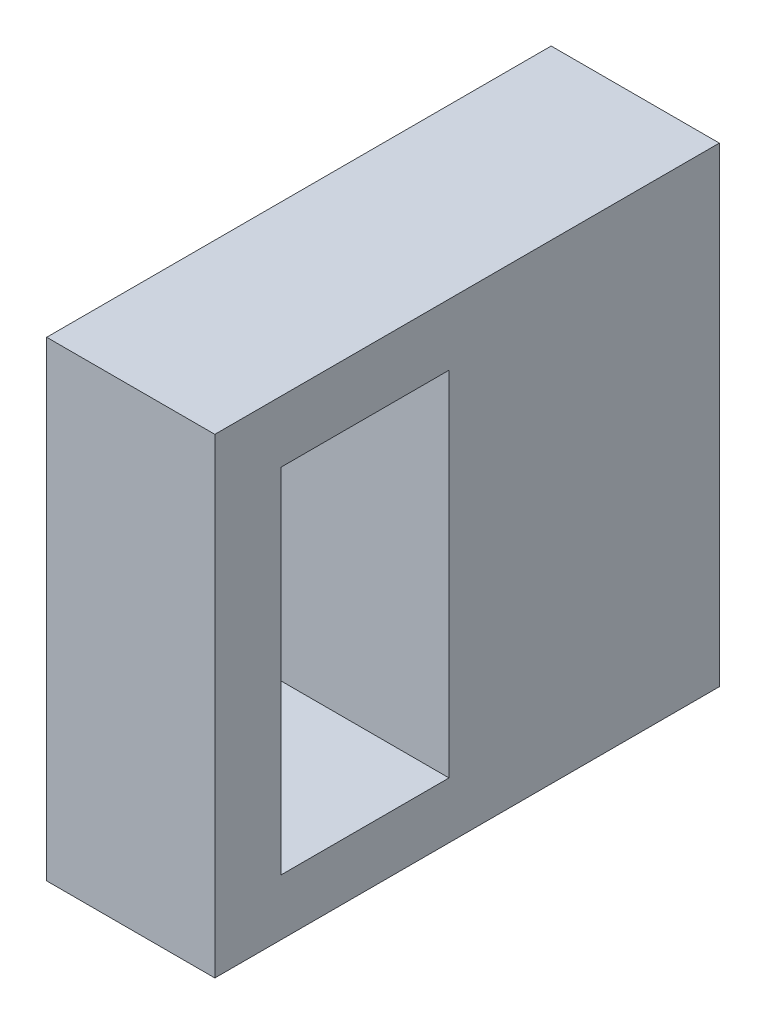
ISO-10303-21;
HEADER;
FILE_DESCRIPTION(('STEP AP214'),'2;1');
FILE_NAME('part.step','',(''),(''),'','','');
FILE_SCHEMA(('AUTOMOTIVE_DESIGN { 1 0 10303 214 1 1 1 1 }'));
ENDSEC;
DATA;
#1=APPLICATION_CONTEXT('core data for automotive mechanical design processes');
#2=APPLICATION_PROTOCOL_DEFINITION('international standard','automotive_design',2000,#1);
#3=PRODUCT_CONTEXT('',#1,'mechanical');
#4=PRODUCT('Part','Part','',(#3));
#5=PRODUCT_RELATED_PRODUCT_CATEGORY('part','',(#4));
#6=PRODUCT_DEFINITION_FORMATION('','',#4);
#7=PRODUCT_DEFINITION_CONTEXT('part definition',#1,'design');
#8=PRODUCT_DEFINITION('design','',#6,#7);
#9=PRODUCT_DEFINITION_SHAPE('','',#8);
#10=(LENGTH_UNIT() NAMED_UNIT(*) SI_UNIT(.MILLI.,.METRE.));
#11=(NAMED_UNIT(*) PLANE_ANGLE_UNIT() SI_UNIT($,.RADIAN.));
#12=(NAMED_UNIT(*) SI_UNIT($,.STERADIAN.) SOLID_ANGLE_UNIT());
#13=UNCERTAINTY_MEASURE_WITH_UNIT(LENGTH_MEASURE(1.E-05),#10,'distance_accuracy_value','');
#14=(GEOMETRIC_REPRESENTATION_CONTEXT(3) GLOBAL_UNCERTAINTY_ASSIGNED_CONTEXT((#13)) GLOBAL_UNIT_ASSIGNED_CONTEXT((#10,
#11,#12)) REPRESENTATION_CONTEXT('',''));
#15=CARTESIAN_POINT('',(0.,0.,0.));
#16=DIRECTION('',(0.,0.,1.));
#17=DIRECTION('',(1.,0.,0.));
#18=AXIS2_PLACEMENT_3D('',#15,#16,#17);
#19=CARTESIAN_POINT('',(-43.8459457780171,1.55754716981132,38.1));
#20=DIRECTION('',(1.,0.,0.));
#21=DIRECTION('',(0.,0.,-1.));
#22=AXIS2_PLACEMENT_3D('',#19,#20,#21);
#23=PLANE('',#22);
#24=DIRECTION('',(0.,-1.,0.));
#25=VECTOR('',#24,1.);
#26=CARTESIAN_POINT('',(-43.8459457780171,32.4703110105043,20.4137232377391));
#27=LINE('',#26,#25);
#28=CARTESIAN_POINT('',(-43.8459457780171,32.4703110105043,20.4137232377391));
#29=VERTEX_POINT('',#28);
#30=CARTESIAN_POINT('',(-43.8459457780171,5.80031101050427,20.4137232377391));
#31=VERTEX_POINT('',#30);
#32=EDGE_CURVE('E109',#29,#31,#27,.T.);
#33=ORIENTED_EDGE('',*,*,#32,.F.);
#34=DIRECTION('',(0.,0.,-1.));
#35=VECTOR('',#34,1.);
#36=CARTESIAN_POINT('',(-43.8459457780171,32.4703110105043,33.1137232377391));
#37=LINE('',#36,#35);
#38=CARTESIAN_POINT('',(-43.8459457780171,32.4703110105043,33.1137232377391));
#39=VERTEX_POINT('',#38);
#40=EDGE_CURVE('E47',#39,#29,#37,.T.);
#41=ORIENTED_EDGE('',*,*,#40,.F.);
#42=DIRECTION('',(0.,1.,0.));
#43=VECTOR('',#42,1.);
#44=CARTESIAN_POINT('',(-43.8459457780171,5.80031101050427,33.1137232377391));
#45=LINE('',#44,#43);
#46=CARTESIAN_POINT('',(-43.8459457780171,5.80031101050427,33.1137232377391));
#47=VERTEX_POINT('',#46);
#48=EDGE_CURVE('E115',#47,#39,#45,.T.);
#49=ORIENTED_EDGE('',*,*,#48,.F.);
#50=DIRECTION('',(0.,0.,1.));
#51=VECTOR('',#50,1.);
#52=CARTESIAN_POINT('',(-43.8459457780171,5.80031101050427,20.4137232377391));
#53=LINE('',#52,#51);
#54=EDGE_CURVE('E100',#31,#47,#53,.T.);
#55=ORIENTED_EDGE('',*,*,#54,.F.);
#56=EDGE_LOOP('',(#33,#41,#49,#55));
#57=FACE_BOUND('',#56,.T.);
#58=DIRECTION('',(0.,-1.,0.));
#59=VECTOR('',#58,1.);
#60=CARTESIAN_POINT('',(-43.8459457780171,1.55754716981132,0.));
#61=LINE('',#60,#59);
#62=CARTESIAN_POINT('',(-43.8459457780171,37.1175471698113,0.));
#63=VERTEX_POINT('',#62);
#64=CARTESIAN_POINT('',(-43.8459457780171,1.55754716981132,0.));
#65=VERTEX_POINT('',#64);
#66=EDGE_CURVE('E122',#63,#65,#61,.T.);
#67=ORIENTED_EDGE('',*,*,#66,.T.);
#68=DIRECTION('',(0.,0.,-1.));
#69=VECTOR('',#68,1.);
#70=CARTESIAN_POINT('',(-43.8459457780171,1.55754716981132,38.1));
#71=LINE('',#70,#69);
#72=CARTESIAN_POINT('',(-43.8459457780171,1.55754716981132,38.1));
#73=VERTEX_POINT('',#72);
#74=EDGE_CURVE('E151',#73,#65,#71,.T.);
#75=ORIENTED_EDGE('',*,*,#74,.F.);
#76=DIRECTION('',(0.,-1.,0.));
#77=VECTOR('',#76,1.);
#78=CARTESIAN_POINT('',(-43.8459457780171,1.55754716981132,38.1));
#79=LINE('',#78,#77);
#80=CARTESIAN_POINT('',(-43.8459457780171,37.1175471698113,38.1));
#81=VERTEX_POINT('',#80);
#82=EDGE_CURVE('E125',#81,#73,#79,.T.);
#83=ORIENTED_EDGE('',*,*,#82,.F.);
#84=DIRECTION('',(0.,0.,-1.));
#85=VECTOR('',#84,1.);
#86=CARTESIAN_POINT('',(-43.8459457780171,37.1175471698113,38.1));
#87=LINE('',#86,#85);
#88=EDGE_CURVE('E135',#81,#63,#87,.T.);
#89=ORIENTED_EDGE('',*,*,#88,.T.);
#90=EDGE_LOOP('',(#67,#75,#83,#89));
#91=FACE_BOUND('',#90,.T.);
#92=ADVANCED_FACE('F33',(#57,#91),#23,.F.);
#93=CARTESIAN_POINT('',(-31.1459457780171,1.55754716981133,38.1));
#94=DIRECTION('',(0.,1.,0.));
#95=DIRECTION('',(-1.,0.,0.));
#96=AXIS2_PLACEMENT_3D('',#93,#94,#95);
#97=PLANE('',#96);
#98=DIRECTION('',(1.,0.,0.));
#99=VECTOR('',#98,1.);
#100=CARTESIAN_POINT('',(-31.1459457780171,1.55754716981133,0.));
#101=LINE('',#100,#99);
#102=CARTESIAN_POINT('',(-31.1459457780171,1.55754716981133,0.));
#103=VERTEX_POINT('',#102);
#104=EDGE_CURVE('E138',#65,#103,#101,.T.);
#105=ORIENTED_EDGE('',*,*,#104,.T.);
#106=DIRECTION('',(0.,0.,-1.));
#107=VECTOR('',#106,1.);
#108=CARTESIAN_POINT('',(-31.1459457780171,1.55754716981133,38.1));
#109=LINE('',#108,#107);
#110=CARTESIAN_POINT('',(-31.1459457780171,1.55754716981133,38.1));
#111=VERTEX_POINT('',#110);
#112=EDGE_CURVE('E148',#111,#103,#109,.T.);
#113=ORIENTED_EDGE('',*,*,#112,.F.);
#114=DIRECTION('',(1.,0.,0.));
#115=VECTOR('',#114,1.);
#116=CARTESIAN_POINT('',(-31.1459457780171,1.55754716981133,38.1));
#117=LINE('',#116,#115);
#118=EDGE_CURVE('E128',#73,#111,#117,.T.);
#119=ORIENTED_EDGE('',*,*,#118,.F.);
#120=ORIENTED_EDGE('',*,*,#74,.T.);
#121=EDGE_LOOP('',(#105,#113,#119,#120));
#122=FACE_BOUND('',#121,.T.);
#123=ADVANCED_FACE('F178',(#122),#97,.F.);
#124=CARTESIAN_POINT('',(-31.1459457780171,37.1175471698113,38.1));
#125=DIRECTION('',(-1.,0.,0.));
#126=DIRECTION('',(0.,-1.,0.));
#127=AXIS2_PLACEMENT_3D('',#124,#125,#126);
#128=PLANE('',#127);
#129=DIRECTION('',(0.,1.,0.));
#130=VECTOR('',#129,1.);
#131=CARTESIAN_POINT('',(-31.1459457780171,37.1175471698113,33.1137232377391));
#132=LINE('',#131,#130);
#133=CARTESIAN_POINT('',(-31.1459457780171,5.80031101050427,33.1137232377391));
#134=VERTEX_POINT('',#133);
#135=CARTESIAN_POINT('',(-31.1459457780171,32.4703110105043,33.1137232377391));
#136=VERTEX_POINT('',#135);
#137=EDGE_CURVE('E40',#134,#136,#132,.T.);
#138=ORIENTED_EDGE('',*,*,#137,.T.);
#139=DIRECTION('',(0.,0.,-1.));
#140=VECTOR('',#139,1.);
#141=CARTESIAN_POINT('',(-31.1459457780171,32.4703110105043,38.1));
#142=LINE('',#141,#140);
#143=CARTESIAN_POINT('',(-31.1459457780171,32.4703110105043,20.4137232377391));
#144=VERTEX_POINT('',#143);
#145=EDGE_CURVE('E11',#136,#144,#142,.T.);
#146=ORIENTED_EDGE('',*,*,#145,.T.);
#147=DIRECTION('',(0.,-1.,0.));
#148=VECTOR('',#147,1.);
#149=CARTESIAN_POINT('',(-31.1459457780171,37.1175471698113,20.4137232377391));
#150=LINE('',#149,#148);
#151=CARTESIAN_POINT('',(-31.1459457780171,5.80031101050427,20.4137232377391));
#152=VERTEX_POINT('',#151);
#153=EDGE_CURVE('E154',#144,#152,#150,.T.);
#154=ORIENTED_EDGE('',*,*,#153,.T.);
#155=DIRECTION('',(0.,0.,1.));
#156=VECTOR('',#155,1.);
#157=CARTESIAN_POINT('',(-31.1459457780171,5.80031101050427,38.1));
#158=LINE('',#157,#156);
#159=EDGE_CURVE('E103',#152,#134,#158,.T.);
#160=ORIENTED_EDGE('',*,*,#159,.T.);
#161=EDGE_LOOP('',(#138,#146,#154,#160));
#162=FACE_BOUND('',#161,.T.);
#163=DIRECTION('',(0.,1.,0.));
#164=VECTOR('',#163,1.);
#165=CARTESIAN_POINT('',(-31.1459457780171,37.1175471698113,0.));
#166=LINE('',#165,#164);
#167=CARTESIAN_POINT('',(-31.1459457780171,37.1175471698113,0.));
#168=VERTEX_POINT('',#167);
#169=EDGE_CURVE('E140',#103,#168,#166,.T.);
#170=ORIENTED_EDGE('',*,*,#169,.T.);
#171=DIRECTION('',(0.,0.,-1.));
#172=VECTOR('',#171,1.);
#173=CARTESIAN_POINT('',(-31.1459457780171,37.1175471698113,38.1));
#174=LINE('',#173,#172);
#175=CARTESIAN_POINT('',(-31.1459457780171,37.1175471698113,38.1));
#176=VERTEX_POINT('',#175);
#177=EDGE_CURVE('E145',#176,#168,#174,.T.);
#178=ORIENTED_EDGE('',*,*,#177,.F.);
#179=DIRECTION('',(0.,1.,0.));
#180=VECTOR('',#179,1.);
#181=CARTESIAN_POINT('',(-31.1459457780171,37.1175471698113,38.1));
#182=LINE('',#181,#180);
#183=EDGE_CURVE('E131',#111,#176,#182,.T.);
#184=ORIENTED_EDGE('',*,*,#183,.F.);
#185=ORIENTED_EDGE('',*,*,#112,.T.);
#186=EDGE_LOOP('',(#170,#178,#184,#185));
#187=FACE_BOUND('',#186,.T.);
#188=ADVANCED_FACE('F158',(#162,#187),#128,.F.);
#189=CARTESIAN_POINT('',(-43.8459457780171,37.1175471698113,38.1));
#190=DIRECTION('',(0.,-1.,0.));
#191=DIRECTION('',(0.,0.,-1.));
#192=AXIS2_PLACEMENT_3D('',#189,#190,#191);
#193=PLANE('',#192);
#194=DIRECTION('',(-1.,0.,0.));
#195=VECTOR('',#194,1.);
#196=CARTESIAN_POINT('',(-43.8459457780171,37.1175471698113,0.));
#197=LINE('',#196,#195);
#198=EDGE_CURVE('E129',#168,#63,#197,.T.);
#199=ORIENTED_EDGE('',*,*,#198,.T.);
#200=ORIENTED_EDGE('',*,*,#88,.F.);
#201=DIRECTION('',(-1.,0.,0.));
#202=VECTOR('',#201,1.);
#203=CARTESIAN_POINT('',(-43.8459457780171,37.1175471698113,38.1));
#204=LINE('',#203,#202);
#205=EDGE_CURVE('E133',#176,#81,#204,.T.);
#206=ORIENTED_EDGE('',*,*,#205,.F.);
#207=ORIENTED_EDGE('',*,*,#177,.T.);
#208=EDGE_LOOP('',(#199,#200,#206,#207));
#209=FACE_BOUND('',#208,.T.);
#210=ADVANCED_FACE('F186',(#209),#193,.F.);
#211=CARTESIAN_POINT('',(0.,0.,38.1));
#212=DIRECTION('',(0.,0.,-1.));
#213=DIRECTION('',(-1.,0.,0.));
#214=AXIS2_PLACEMENT_3D('',#211,#212,#213);
#215=PLANE('',#214);
#216=ORIENTED_EDGE('',*,*,#82,.T.);
#217=ORIENTED_EDGE('',*,*,#118,.T.);
#218=ORIENTED_EDGE('',*,*,#183,.T.);
#219=ORIENTED_EDGE('',*,*,#205,.T.);
#220=EDGE_LOOP('',(#216,#217,#218,#219));
#221=FACE_BOUND('',#220,.T.);
#222=ADVANCED_FACE('F172',(#221),#215,.F.);
#223=CARTESIAN_POINT('',(0.,0.,0.));
#224=DIRECTION('',(0.,0.,-1.));
#225=DIRECTION('',(-1.,0.,0.));
#226=AXIS2_PLACEMENT_3D('',#223,#224,#225);
#227=PLANE('',#226);
#228=ORIENTED_EDGE('',*,*,#66,.F.);
#229=ORIENTED_EDGE('',*,*,#198,.F.);
#230=ORIENTED_EDGE('',*,*,#169,.F.);
#231=ORIENTED_EDGE('',*,*,#104,.F.);
#232=EDGE_LOOP('',(#228,#229,#230,#231));
#233=FACE_BOUND('',#232,.T.);
#234=ADVANCED_FACE('F165',(#233),#227,.T.);
#235=CARTESIAN_POINT('',(-5.74594577801712,32.4703110105043,33.1137232377391));
#236=DIRECTION('',(0.,1.,0.));
#237=DIRECTION('',(0.,0.,1.));
#238=AXIS2_PLACEMENT_3D('',#235,#236,#237);
#239=PLANE('',#238);
#240=DIRECTION('',(-1.,0.,0.));
#241=VECTOR('',#240,1.);
#242=CARTESIAN_POINT('',(-5.74594577801712,32.4703110105043,33.1137232377391));
#243=LINE('',#242,#241);
#244=EDGE_CURVE('E120',#136,#39,#243,.T.);
#245=ORIENTED_EDGE('',*,*,#244,.T.);
#246=ORIENTED_EDGE('',*,*,#40,.T.);
#247=DIRECTION('',(-1.,0.,0.));
#248=VECTOR('',#247,1.);
#249=CARTESIAN_POINT('',(-5.74594577801712,32.4703110105043,20.4137232377391));
#250=LINE('',#249,#248);
#251=EDGE_CURVE('E106',#144,#29,#250,.T.);
#252=ORIENTED_EDGE('',*,*,#251,.F.);
#253=ORIENTED_EDGE('',*,*,#145,.F.);
#254=EDGE_LOOP('',(#245,#246,#252,#253));
#255=FACE_BOUND('',#254,.T.);
#256=ADVANCED_FACE('F163',(#255),#239,.F.);
#257=CARTESIAN_POINT('',(-5.74594577801712,5.80031101050427,33.1137232377391));
#258=DIRECTION('',(0.,0.,1.));
#259=DIRECTION('',(1.,0.,0.));
#260=AXIS2_PLACEMENT_3D('',#257,#258,#259);
#261=PLANE('',#260);
#262=DIRECTION('',(-1.,0.,0.));
#263=VECTOR('',#262,1.);
#264=CARTESIAN_POINT('',(-5.74594577801712,5.80031101050427,33.1137232377391));
#265=LINE('',#264,#263);
#266=EDGE_CURVE('E105',#134,#47,#265,.T.);
#267=ORIENTED_EDGE('',*,*,#266,.T.);
#268=ORIENTED_EDGE('',*,*,#48,.T.);
#269=ORIENTED_EDGE('',*,*,#244,.F.);
#270=ORIENTED_EDGE('',*,*,#137,.F.);
#271=EDGE_LOOP('',(#267,#268,#269,#270));
#272=FACE_BOUND('',#271,.T.);
#273=ADVANCED_FACE('F162',(#272),#261,.F.);
#274=CARTESIAN_POINT('',(-5.74594577801712,5.80031101050427,20.4137232377391));
#275=DIRECTION('',(0.,-1.,0.));
#276=DIRECTION('',(0.,0.,-1.));
#277=AXIS2_PLACEMENT_3D('',#274,#275,#276);
#278=PLANE('',#277);
#279=DIRECTION('',(-1.,0.,0.));
#280=VECTOR('',#279,1.);
#281=CARTESIAN_POINT('',(-5.74594577801712,5.80031101050427,20.4137232377391));
#282=LINE('',#281,#280);
#283=EDGE_CURVE('E55',#152,#31,#282,.T.);
#284=ORIENTED_EDGE('',*,*,#283,.T.);
#285=ORIENTED_EDGE('',*,*,#54,.T.);
#286=ORIENTED_EDGE('',*,*,#266,.F.);
#287=ORIENTED_EDGE('',*,*,#159,.F.);
#288=EDGE_LOOP('',(#284,#285,#286,#287));
#289=FACE_BOUND('',#288,.T.);
#290=ADVANCED_FACE('F97',(#289),#278,.F.);
#291=CARTESIAN_POINT('',(-5.74594577801712,32.4703110105043,20.4137232377391));
#292=DIRECTION('',(0.,0.,-1.));
#293=DIRECTION('',(0.,1.,0.));
#294=AXIS2_PLACEMENT_3D('',#291,#292,#293);
#295=PLANE('',#294);
#296=ORIENTED_EDGE('',*,*,#251,.T.);
#297=ORIENTED_EDGE('',*,*,#32,.T.);
#298=ORIENTED_EDGE('',*,*,#283,.F.);
#299=ORIENTED_EDGE('',*,*,#153,.F.);
#300=EDGE_LOOP('',(#296,#297,#298,#299));
#301=FACE_BOUND('',#300,.T.);
#302=ADVANCED_FACE('F110',(#301),#295,.F.);
#303=CLOSED_SHELL('',(#92,#123,#188,#210,#222,#234,#256,#273,#290,#302));
#304=MANIFOLD_SOLID_BREP('B2',#303);
#305=ADVANCED_BREP_SHAPE_REPRESENTATION('',(#18,#304),#14);
#306=SHAPE_DEFINITION_REPRESENTATION(#9,#305);
ENDSEC;
END-ISO-10303-21;
